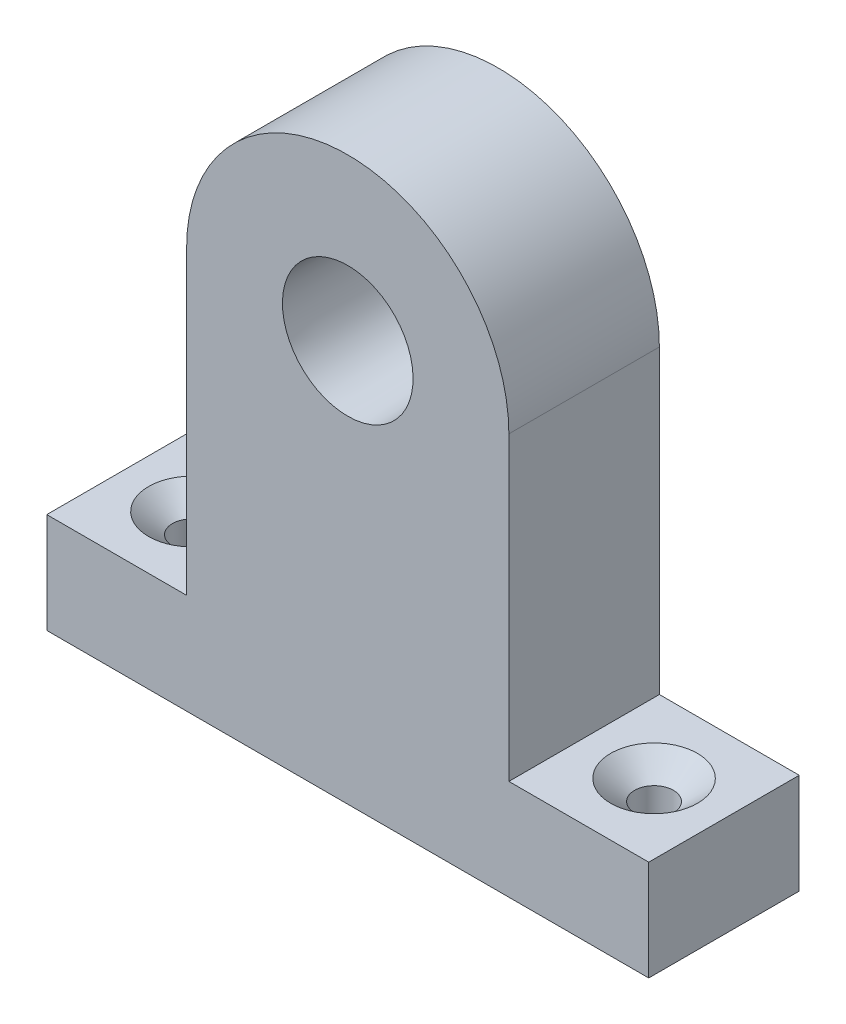
ISO-10303-21;
HEADER;
FILE_DESCRIPTION(('STEP AP214'),'2;1');
FILE_NAME('part.step','',(''),(''),'','','');
FILE_SCHEMA(('AUTOMOTIVE_DESIGN { 1 0 10303 214 1 1 1 1 }'));
ENDSEC;
DATA;
#1=APPLICATION_CONTEXT('core data for automotive mechanical design processes');
#2=APPLICATION_PROTOCOL_DEFINITION('international standard','automotive_design',2000,#1);
#3=PRODUCT_CONTEXT('',#1,'mechanical');
#4=PRODUCT('Part','Part','',(#3));
#5=PRODUCT_RELATED_PRODUCT_CATEGORY('part','',(#4));
#6=PRODUCT_DEFINITION_FORMATION('','',#4);
#7=PRODUCT_DEFINITION_CONTEXT('part definition',#1,'design');
#8=PRODUCT_DEFINITION('design','',#6,#7);
#9=PRODUCT_DEFINITION_SHAPE('','',#8);
#10=(LENGTH_UNIT() NAMED_UNIT(*) SI_UNIT(.MILLI.,.METRE.));
#11=(NAMED_UNIT(*) PLANE_ANGLE_UNIT() SI_UNIT($,.RADIAN.));
#12=(NAMED_UNIT(*) SI_UNIT($,.STERADIAN.) SOLID_ANGLE_UNIT());
#13=UNCERTAINTY_MEASURE_WITH_UNIT(LENGTH_MEASURE(1.E-05),#10,'distance_accuracy_value','');
#14=(GEOMETRIC_REPRESENTATION_CONTEXT(3) GLOBAL_UNCERTAINTY_ASSIGNED_CONTEXT((#13)) GLOBAL_UNIT_ASSIGNED_CONTEXT((#10,
#11,#12)) REPRESENTATION_CONTEXT('',''));
#15=CARTESIAN_POINT('',(0.,0.,0.));
#16=DIRECTION('',(0.,0.,1.));
#17=DIRECTION('',(1.,0.,0.));
#18=AXIS2_PLACEMENT_3D('',#15,#16,#17);
#19=CARTESIAN_POINT('',(-38.1,123.19,-107.95));
#20=DIRECTION('',(1.,0.,0.));
#21=DIRECTION('',(0.,0.,-1.));
#22=AXIS2_PLACEMENT_3D('',#19,#20,#21);
#23=PLANE('',#22);
#24=DIRECTION('',(0.,0.,-1.));
#25=VECTOR('',#24,1.);
#26=CARTESIAN_POINT('',(-38.1,31.75,-88.8999999999999));
#27=LINE('',#26,#25);
#28=CARTESIAN_POINT('',(-38.1,31.75,-88.8999999999999));
#29=VERTEX_POINT('',#28);
#30=CARTESIAN_POINT('',(-38.1,31.75,-107.95));
#31=VERTEX_POINT('',#30);
#32=EDGE_CURVE('E191',#29,#31,#27,.T.);
#33=ORIENTED_EDGE('',*,*,#32,.T.);
#34=DIRECTION('',(0.,-1.,0.));
#35=VECTOR('',#34,1.);
#36=CARTESIAN_POINT('',(-38.1,123.19,-107.95));
#37=LINE('',#36,#35);
#38=CARTESIAN_POINT('',(-38.1,19.05,-107.95));
#39=VERTEX_POINT('',#38);
#40=EDGE_CURVE('E99',#31,#39,#37,.T.);
#41=ORIENTED_EDGE('',*,*,#40,.T.);
#42=DIRECTION('',(0.,0.,1.));
#43=VECTOR('',#42,1.);
#44=CARTESIAN_POINT('',(-38.1,19.05,-107.95));
#45=LINE('',#44,#43);
#46=CARTESIAN_POINT('',(-38.1,19.05,-88.9));
#47=VERTEX_POINT('',#46);
#48=EDGE_CURVE('E197',#39,#47,#45,.T.);
#49=ORIENTED_EDGE('',*,*,#48,.T.);
#50=DIRECTION('',(0.,-1.,0.));
#51=VECTOR('',#50,1.);
#52=CARTESIAN_POINT('',(-38.1,123.19,-88.9));
#53=LINE('',#52,#51);
#54=EDGE_CURVE('E47',#29,#47,#53,.T.);
#55=ORIENTED_EDGE('',*,*,#54,.F.);
#56=EDGE_LOOP('',(#33,#41,#49,#55));
#57=FACE_BOUND('',#56,.T.);
#58=ADVANCED_FACE('F76',(#57),#23,.F.);
#59=CARTESIAN_POINT('',(-38.1,123.19,-88.9));
#60=DIRECTION('',(0.,0.,-1.));
#61=DIRECTION('',(-1.,0.,0.));
#62=AXIS2_PLACEMENT_3D('',#59,#60,#61);
#63=PLANE('',#62);
#64=CARTESIAN_POINT('',(0.,69.8500000000001,-88.9));
#65=DIRECTION('',(0.,0.,-1.));
#66=DIRECTION('',(-1.,0.,0.));
#67=AXIS2_PLACEMENT_3D('',#64,#65,#66);
#68=CIRCLE('',#67,8.26624249261168);
#69=CARTESIAN_POINT('',(0.,61.5837575073885,-88.9));
#70=VERTEX_POINT('',#69);
#71=EDGE_CURVE('E194',#70,#70,#68,.T.);
#72=ORIENTED_EDGE('',*,*,#71,.T.);
#73=EDGE_LOOP('',(#72));
#74=FACE_BOUND('',#73,.T.);
#75=DIRECTION('',(0.,-1.,0.));
#76=VECTOR('',#75,1.);
#77=CARTESIAN_POINT('',(38.1,123.19,-88.9));
#78=LINE('',#77,#76);
#79=CARTESIAN_POINT('',(38.1,31.75,-88.9));
#80=VERTEX_POINT('',#79);
#81=CARTESIAN_POINT('',(38.1,19.05,-88.9));
#82=VERTEX_POINT('',#81);
#83=EDGE_CURVE('E84',#80,#82,#78,.T.);
#84=ORIENTED_EDGE('',*,*,#83,.F.);
#85=DIRECTION('',(-1.,0.,0.));
#86=VECTOR('',#85,1.);
#87=CARTESIAN_POINT('',(0.,31.75,-88.8999999999999));
#88=LINE('',#87,#86);
#89=CARTESIAN_POINT('',(20.3963039680216,31.75,-88.9));
#90=VERTEX_POINT('',#89);
#91=EDGE_CURVE('E174',#80,#90,#88,.T.);
#92=ORIENTED_EDGE('',*,*,#91,.T.);
#93=DIRECTION('',(0.,1.,0.));
#94=VECTOR('',#93,1.);
#95=CARTESIAN_POINT('',(20.3963039680216,0.,-88.9));
#96=LINE('',#95,#94);
#97=CARTESIAN_POINT('',(20.3963039680216,69.8500000000001,-88.9));
#98=VERTEX_POINT('',#97);
#99=EDGE_CURVE('E157',#90,#98,#96,.T.);
#100=ORIENTED_EDGE('',*,*,#99,.T.);
#101=CARTESIAN_POINT('',(0.,69.8500000000001,-88.8999999999999));
#102=DIRECTION('',(0.,0.,-1.));
#103=DIRECTION('',(-1.,0.,0.));
#104=AXIS2_PLACEMENT_3D('',#101,#102,#103);
#105=CIRCLE('',#104,20.3963039680215);
#106=CARTESIAN_POINT('',(-20.3963039680216,69.8500000000001,-88.8999999999999));
#107=VERTEX_POINT('',#106);
#108=EDGE_CURVE('E153',#107,#98,#105,.T.);
#109=ORIENTED_EDGE('',*,*,#108,.F.);
#110=DIRECTION('',(0.,1.,0.));
#111=VECTOR('',#110,1.);
#112=CARTESIAN_POINT('',(-20.3963039680216,0.,-88.8999999999999));
#113=LINE('',#112,#111);
#114=CARTESIAN_POINT('',(-20.3963039680216,31.75,-88.8999999999999));
#115=VERTEX_POINT('',#114);
#116=EDGE_CURVE('E143',#115,#107,#113,.T.);
#117=ORIENTED_EDGE('',*,*,#116,.F.);
#118=DIRECTION('',(1.,0.,0.));
#119=VECTOR('',#118,1.);
#120=CARTESIAN_POINT('',(0.,31.7499999999999,-88.8999999999999));
#121=LINE('',#120,#119);
#122=EDGE_CURVE('E152',#29,#115,#121,.T.);
#123=ORIENTED_EDGE('',*,*,#122,.F.);
#124=ORIENTED_EDGE('',*,*,#54,.T.);
#125=DIRECTION('',(1.,0.,0.));
#126=VECTOR('',#125,1.);
#127=CARTESIAN_POINT('',(-38.1,19.05,-88.9));
#128=LINE('',#127,#126);
#129=EDGE_CURVE('E199',#47,#82,#128,.T.);
#130=ORIENTED_EDGE('',*,*,#129,.T.);
#131=EDGE_LOOP('',(#84,#92,#100,#109,#117,#123,#124,#130));
#132=FACE_BOUND('',#131,.T.);
#133=ADVANCED_FACE('F161',(#74,#132),#63,.F.);
#134=CARTESIAN_POINT('',(38.1,123.19,-107.95));
#135=DIRECTION('',(-1.,0.,0.));
#136=DIRECTION('',(0.,0.,1.));
#137=AXIS2_PLACEMENT_3D('',#134,#135,#136);
#138=PLANE('',#137);
#139=DIRECTION('',(0.,-1.,0.));
#140=VECTOR('',#139,1.);
#141=CARTESIAN_POINT('',(38.1,123.19,-107.95));
#142=LINE('',#141,#140);
#143=CARTESIAN_POINT('',(38.1,31.75,-107.95));
#144=VERTEX_POINT('',#143);
#145=CARTESIAN_POINT('',(38.1,19.05,-107.95));
#146=VERTEX_POINT('',#145);
#147=EDGE_CURVE('E208',#144,#146,#142,.T.);
#148=ORIENTED_EDGE('',*,*,#147,.F.);
#149=DIRECTION('',(0.,0.,-1.));
#150=VECTOR('',#149,1.);
#151=CARTESIAN_POINT('',(38.1,31.75,-88.9));
#152=LINE('',#151,#150);
#153=EDGE_CURVE('E189',#80,#144,#152,.T.);
#154=ORIENTED_EDGE('',*,*,#153,.F.);
#155=ORIENTED_EDGE('',*,*,#83,.T.);
#156=DIRECTION('',(0.,0.,-1.));
#157=VECTOR('',#156,1.);
#158=CARTESIAN_POINT('',(38.1,19.05,-107.95));
#159=LINE('',#158,#157);
#160=EDGE_CURVE('E202',#82,#146,#159,.T.);
#161=ORIENTED_EDGE('',*,*,#160,.T.);
#162=EDGE_LOOP('',(#148,#154,#155,#161));
#163=FACE_BOUND('',#162,.T.);
#164=ADVANCED_FACE('F213',(#163),#138,.F.);
#165=CARTESIAN_POINT('',(-38.1,123.19,-107.95));
#166=DIRECTION('',(0.,0.,1.));
#167=DIRECTION('',(1.,0.,0.));
#168=AXIS2_PLACEMENT_3D('',#165,#166,#167);
#169=PLANE('',#168);
#170=DIRECTION('',(0.,1.,0.));
#171=VECTOR('',#170,1.);
#172=CARTESIAN_POINT('',(20.3963039680216,0.,-107.95));
#173=LINE('',#172,#171);
#174=CARTESIAN_POINT('',(20.3963039680216,31.75,-107.95));
#175=VERTEX_POINT('',#174);
#176=CARTESIAN_POINT('',(20.3963039680216,69.8500000000001,-107.95));
#177=VERTEX_POINT('',#176);
#178=EDGE_CURVE('E164',#175,#177,#173,.T.);
#179=ORIENTED_EDGE('',*,*,#178,.F.);
#180=DIRECTION('',(-1.,0.,0.));
#181=VECTOR('',#180,1.);
#182=CARTESIAN_POINT('',(0.,31.75,-107.95));
#183=LINE('',#182,#181);
#184=EDGE_CURVE('E167',#144,#175,#183,.T.);
#185=ORIENTED_EDGE('',*,*,#184,.F.);
#186=ORIENTED_EDGE('',*,*,#147,.T.);
#187=DIRECTION('',(-1.,0.,0.));
#188=VECTOR('',#187,1.);
#189=CARTESIAN_POINT('',(-38.1,19.05,-107.95));
#190=LINE('',#189,#188);
#191=EDGE_CURVE('E205',#146,#39,#190,.T.);
#192=ORIENTED_EDGE('',*,*,#191,.T.);
#193=ORIENTED_EDGE('',*,*,#40,.F.);
#194=DIRECTION('',(1.,0.,0.));
#195=VECTOR('',#194,1.);
#196=CARTESIAN_POINT('',(0.,31.7499999999999,-107.95));
#197=LINE('',#196,#195);
#198=CARTESIAN_POINT('',(-20.3963039680216,31.75,-107.95));
#199=VERTEX_POINT('',#198);
#200=EDGE_CURVE('E180',#31,#199,#197,.T.);
#201=ORIENTED_EDGE('',*,*,#200,.T.);
#202=DIRECTION('',(0.,1.,0.));
#203=VECTOR('',#202,1.);
#204=CARTESIAN_POINT('',(-20.3963039680216,0.,-107.95));
#205=LINE('',#204,#203);
#206=CARTESIAN_POINT('',(-20.3963039680216,69.8500000000001,-107.95));
#207=VERTEX_POINT('',#206);
#208=EDGE_CURVE('E178',#199,#207,#205,.T.);
#209=ORIENTED_EDGE('',*,*,#208,.T.);
#210=CARTESIAN_POINT('',(0.,69.8500000000001,-107.95));
#211=DIRECTION('',(0.,0.,-1.));
#212=DIRECTION('',(-1.,0.,0.));
#213=AXIS2_PLACEMENT_3D('',#210,#211,#212);
#214=CIRCLE('',#213,20.3963039680215);
#215=EDGE_CURVE('E91',#207,#177,#214,.T.);
#216=ORIENTED_EDGE('',*,*,#215,.T.);
#217=EDGE_LOOP('',(#179,#185,#186,#192,#193,#201,#209,#216));
#218=FACE_BOUND('',#217,.T.);
#219=CARTESIAN_POINT('',(0.,69.8500000000001,-107.95));
#220=DIRECTION('',(0.,0.,1.));
#221=DIRECTION('',(1.,0.,0.));
#222=AXIS2_PLACEMENT_3D('',#219,#220,#221);
#223=CIRCLE('',#222,7.69630396802151);
#224=CARTESIAN_POINT('',(0.,62.1536960319786,-107.95));
#225=VERTEX_POINT('',#224);
#226=EDGE_CURVE('E79',#225,#225,#223,.T.);
#227=ORIENTED_EDGE('',*,*,#226,.T.);
#228=EDGE_LOOP('',(#227));
#229=FACE_BOUND('',#228,.T.);
#230=ADVANCED_FACE('F223',(#218,#229),#169,.F.);
#231=CARTESIAN_POINT('',(0.,19.05,0.));
#232=DIRECTION('',(0.,1.,0.));
#233=DIRECTION('',(0.,0.,1.));
#234=AXIS2_PLACEMENT_3D('',#231,#232,#233);
#235=PLANE('',#234);
#236=CARTESIAN_POINT('',(-29.2481519840108,19.05,-98.425));
#237=DIRECTION('',(0.,1.,0.));
#238=DIRECTION('',(0.,0.,1.));
#239=AXIS2_PLACEMENT_3D('',#236,#237,#238);
#240=CIRCLE('',#239,2.45744999999999);
#241=CARTESIAN_POINT('',(-29.2481519840108,19.05,-95.96755));
#242=VERTEX_POINT('',#241);
#243=EDGE_CURVE('E288',#242,#242,#240,.T.);
#244=ORIENTED_EDGE('',*,*,#243,.T.);
#245=EDGE_LOOP('',(#244));
#246=FACE_BOUND('',#245,.T.);
#247=CARTESIAN_POINT('',(29.2481519840108,19.05,-98.425));
#248=DIRECTION('',(0.,1.,0.));
#249=DIRECTION('',(0.,0.,1.));
#250=AXIS2_PLACEMENT_3D('',#247,#248,#249);
#251=CIRCLE('',#250,2.45744999999999);
#252=CARTESIAN_POINT('',(29.2481519840108,19.05,-95.96755));
#253=VERTEX_POINT('',#252);
#254=EDGE_CURVE('E170',#253,#253,#251,.T.);
#255=ORIENTED_EDGE('',*,*,#254,.T.);
#256=EDGE_LOOP('',(#255));
#257=FACE_BOUND('',#256,.T.);
#258=ORIENTED_EDGE('',*,*,#48,.F.);
#259=ORIENTED_EDGE('',*,*,#191,.F.);
#260=ORIENTED_EDGE('',*,*,#160,.F.);
#261=ORIENTED_EDGE('',*,*,#129,.F.);
#262=EDGE_LOOP('',(#258,#259,#260,#261));
#263=FACE_BOUND('',#262,.T.);
#264=ADVANCED_FACE('F220',(#246,#257,#263),#235,.F.);
#265=CARTESIAN_POINT('',(0.,69.8500000000001,-64.5055523260613));
#266=DIRECTION('',(0.,0.,1.));
#267=DIRECTION('',(0.,-1.,0.));
#268=AXIS2_PLACEMENT_3D('',#265,#266,#267);
#269=CONICAL_SURFACE('',#268,8.99607637793853,0.0299091111469074);
#270=CARTESIAN_POINT('',(0.,62.1536960319786,-107.95));
#271=CARTESIAN_POINT('',(0.,62.1477591723475,-107.7515625));
#272=CARTESIAN_POINT('',(0.,62.1418223127163,-107.553125));
#273=CARTESIAN_POINT('',(0.,62.129948593454,-107.15625));
#274=CARTESIAN_POINT('',(0.,62.1240117338229,-106.9578125));
#275=CARTESIAN_POINT('',(0.,62.1121380145606,-106.5609375));
#276=CARTESIAN_POINT('',(0.,62.1062011549294,-106.3625));
#277=CARTESIAN_POINT('',(0.,62.0943274356671,-105.965625));
#278=CARTESIAN_POINT('',(0.,62.088390576036,-105.7671875));
#279=CARTESIAN_POINT('',(0.,62.0765168567737,-105.3703125));
#280=CARTESIAN_POINT('',(0.,62.0705799971426,-105.171875));
#281=CARTESIAN_POINT('',(0.,62.0587062778803,-104.775));
#282=CARTESIAN_POINT('',(0.,62.0527694182491,-104.5765625));
#283=CARTESIAN_POINT('',(0.,62.0408956989868,-104.1796875));
#284=CARTESIAN_POINT('',(0.,62.0349588393557,-103.98125));
#285=CARTESIAN_POINT('',(0.,62.0230851200934,-103.584375));
#286=CARTESIAN_POINT('',(0.,62.0171482604622,-103.3859375));
#287=CARTESIAN_POINT('',(0.,62.0052745411999,-102.9890625));
#288=CARTESIAN_POINT('',(0.,61.9993376815688,-102.790625));
#289=CARTESIAN_POINT('',(0.,61.9874639623065,-102.39375));
#290=CARTESIAN_POINT('',(0.,61.9815271026753,-102.1953125));
#291=CARTESIAN_POINT('',(0.,61.969653383413,-101.7984375));
#292=CARTESIAN_POINT('',(0.,61.9637165237819,-101.6));
#293=CARTESIAN_POINT('',(0.,61.9518428045196,-101.203125));
#294=CARTESIAN_POINT('',(0.,61.9459059448885,-101.0046875));
#295=CARTESIAN_POINT('',(0.,61.9340322256262,-100.6078125));
#296=CARTESIAN_POINT('',(0.,61.928095365995,-100.409375));
#297=CARTESIAN_POINT('',(0.,61.9162216467327,-100.0125));
#298=CARTESIAN_POINT('',(0.,61.9102847871016,-99.8140625));
#299=CARTESIAN_POINT('',(0.,61.8984110678393,-99.4171875));
#300=CARTESIAN_POINT('',(0.,61.8924742082081,-99.21875));
#301=CARTESIAN_POINT('',(0.,61.8806004889458,-98.821875));
#302=CARTESIAN_POINT('',(0.,61.8746636293147,-98.6234375));
#303=CARTESIAN_POINT('',(0.,61.8627899100524,-98.2265625));
#304=CARTESIAN_POINT('',(0.,61.8568530504212,-98.028125));
#305=CARTESIAN_POINT('',(0.,61.8449793311589,-97.63125));
#306=CARTESIAN_POINT('',(0.,61.8390424715278,-97.4328125));
#307=CARTESIAN_POINT('',(0.,61.8271687522655,-97.0359375));
#308=CARTESIAN_POINT('',(0.,61.8212318926344,-96.8375));
#309=CARTESIAN_POINT('',(0.,61.8093581733721,-96.440625));
#310=CARTESIAN_POINT('',(0.,61.8034213137409,-96.2421875));
#311=CARTESIAN_POINT('',(0.,61.7915475944786,-95.8453125));
#312=CARTESIAN_POINT('',(0.,61.7856107348475,-95.646875));
#313=CARTESIAN_POINT('',(0.,61.7737370155852,-95.25));
#314=CARTESIAN_POINT('',(0.,61.767800155954,-95.0515625));
#315=CARTESIAN_POINT('',(0.,61.7559264366917,-94.6546875));
#316=CARTESIAN_POINT('',(0.,61.7499895770606,-94.45625));
#317=CARTESIAN_POINT('',(0.,61.7381158577983,-94.059375));
#318=CARTESIAN_POINT('',(0.,61.7321789981671,-93.8609375));
#319=CARTESIAN_POINT('',(0.,61.7203052789048,-93.4640625));
#320=CARTESIAN_POINT('',(0.,61.7143684192737,-93.265625));
#321=CARTESIAN_POINT('',(0.,61.7024947000114,-92.86875));
#322=CARTESIAN_POINT('',(0.,61.6965578403803,-92.6703125));
#323=CARTESIAN_POINT('',(0.,61.684684121118,-92.2734375));
#324=CARTESIAN_POINT('',(0.,61.6787472614868,-92.075));
#325=CARTESIAN_POINT('',(0.,61.6668735422245,-91.678125));
#326=CARTESIAN_POINT('',(0.,61.6609366825934,-91.4796875));
#327=CARTESIAN_POINT('',(0.,61.6490629633311,-91.0828125));
#328=CARTESIAN_POINT('',(0.,61.6431261036999,-90.884375));
#329=CARTESIAN_POINT('',(0.,61.6312523844376,-90.4875));
#330=CARTESIAN_POINT('',(0.,61.6253155248065,-90.2890625));
#331=CARTESIAN_POINT('',(0.,61.6134418055442,-89.8921875));
#332=CARTESIAN_POINT('',(0.,61.607504945913,-89.69375));
#333=CARTESIAN_POINT('',(0.,61.5956312266507,-89.296875));
#334=CARTESIAN_POINT('',(0.,61.5896943670196,-89.0984375));
#335=CARTESIAN_POINT('',(0.,61.5837575073885,-88.9));
#336=B_SPLINE_CURVE_WITH_KNOTS('',3,(#270,#271,#272,#273,#274,#275,#276,#277,#278,#279,#280,
#281,#282,#283,#284,#285,#286,#287,#288,#289,#290,#291,#292,#293,#294,#295,#296,#297,#298,#299,
#300,#301,#302,#303,#304,#305,#306,#307,#308,#309,#310,#311,#312,#313,#314,#315,#316,#317,#318,
#319,#320,#321,#322,#323,#324,#325,#326,#327,#328,#329,#330,#331,#332,#333,#334,#335),
.UNSPECIFIED.,.F.,.F.,(4,2,2,2,2,2,2,2,2,2,2,2,2,2,2,2,2,2,2,2,2,2,2,2,2,2,2,2,2,2,2,2,4),(0.,
0.595578869148973,1.19115773829795,1.78673660744692,2.38231547659589,2.97789434574487,
3.57347321489385,4.16905208404283,4.7646309531918,5.36020982234077,5.95578869148975,
6.55136756063872,7.1469464297877,7.74252529893667,8.33810416808564,8.93368303723461,
9.52926190638359,10.1248407755326,10.7204196446815,11.3159985138305,11.9115773829795,
12.5071562521285,13.1027351212774,13.6983139904264,14.2938928595754,14.8894717287243,
15.4850505978733,16.0806294670223,16.6762083361713,17.2717872053202,17.8673660744692,
18.4629449436182,19.0585238127672),.UNSPECIFIED.);
#337=EDGE_CURVE('BSEAM246',#225,#70,#336,.T.);
#338=ORIENTED_EDGE('',*,*,#226,.F.);
#339=ORIENTED_EDGE('',*,*,#71,.F.);
#340=ORIENTED_EDGE('',*,*,#337,.T.);
#341=ORIENTED_EDGE('',*,*,#337,.F.);
#342=EDGE_LOOP('',(#338,#340,#339,#341));
#343=FACE_BOUND('',#342,.T.);
#344=ADVANCED_FACE('F246',(#343),#269,.F.);
#345=CARTESIAN_POINT('',(0.,69.8500000000001,-88.8999999999999));
#346=DIRECTION('',(0.,0.,-1.));
#347=DIRECTION('',(-1.,0.,0.));
#348=AXIS2_PLACEMENT_3D('',#345,#346,#347);
#349=CYLINDRICAL_SURFACE('',#348,20.3963039680215);
#350=ORIENTED_EDGE('',*,*,#215,.F.);
#351=DIRECTION('',(0.,0.,-1.));
#352=VECTOR('',#351,1.);
#353=CARTESIAN_POINT('',(-20.3963039680216,69.8500000000001,-88.8999999999999));
#354=LINE('',#353,#352);
#355=EDGE_CURVE('E146',#107,#207,#354,.T.);
#356=ORIENTED_EDGE('',*,*,#355,.F.);
#357=ORIENTED_EDGE('',*,*,#108,.T.);
#358=DIRECTION('',(0.,0.,-1.));
#359=VECTOR('',#358,1.);
#360=CARTESIAN_POINT('',(20.3963039680216,69.8500000000001,-88.9));
#361=LINE('',#360,#359);
#362=EDGE_CURVE('E185',#98,#177,#361,.T.);
#363=ORIENTED_EDGE('',*,*,#362,.T.);
#364=EDGE_LOOP('',(#350,#356,#357,#363));
#365=FACE_BOUND('',#364,.T.);
#366=ADVANCED_FACE('F155',(#365),#349,.T.);
#367=CARTESIAN_POINT('',(20.3963039680216,0.,-88.9));
#368=DIRECTION('',(-1.,0.,0.));
#369=DIRECTION('',(0.,0.,1.));
#370=AXIS2_PLACEMENT_3D('',#367,#368,#369);
#371=PLANE('',#370);
#372=ORIENTED_EDGE('',*,*,#178,.T.);
#373=ORIENTED_EDGE('',*,*,#362,.F.);
#374=ORIENTED_EDGE('',*,*,#99,.F.);
#375=DIRECTION('',(0.,0.,-1.));
#376=VECTOR('',#375,1.);
#377=CARTESIAN_POINT('',(20.3963039680216,31.75,-88.9));
#378=LINE('',#377,#376);
#379=EDGE_CURVE('E187',#90,#175,#378,.T.);
#380=ORIENTED_EDGE('',*,*,#379,.T.);
#381=EDGE_LOOP('',(#372,#373,#374,#380));
#382=FACE_BOUND('',#381,.T.);
#383=ADVANCED_FACE('F229',(#382),#371,.F.);
#384=CARTESIAN_POINT('',(0.,31.75,-88.8999999999999));
#385=DIRECTION('',(0.,-1.,0.));
#386=DIRECTION('',(0.,0.,-1.));
#387=AXIS2_PLACEMENT_3D('',#384,#385,#386);
#388=PLANE('',#387);
#389=CARTESIAN_POINT('',(29.2481519840108,31.75,-98.425));
#390=DIRECTION('',(0.,1.,0.));
#391=DIRECTION('',(0.,0.,1.));
#392=AXIS2_PLACEMENT_3D('',#389,#390,#391);
#393=CIRCLE('',#392,5.4864);
#394=CARTESIAN_POINT('',(29.2481519840108,31.75,-92.9386));
#395=VERTEX_POINT('',#394);
#396=EDGE_CURVE('E293',#395,#395,#393,.T.);
#397=ORIENTED_EDGE('',*,*,#396,.F.);
#398=EDGE_LOOP('',(#397));
#399=FACE_BOUND('',#398,.T.);
#400=ORIENTED_EDGE('',*,*,#184,.T.);
#401=ORIENTED_EDGE('',*,*,#379,.F.);
#402=ORIENTED_EDGE('',*,*,#91,.F.);
#403=ORIENTED_EDGE('',*,*,#153,.T.);
#404=EDGE_LOOP('',(#400,#401,#402,#403));
#405=FACE_BOUND('',#404,.T.);
#406=ADVANCED_FACE('F227',(#399,#405),#388,.F.);
#407=CARTESIAN_POINT('',(0.,31.7499999999999,-88.8999999999999));
#408=DIRECTION('',(0.,1.,0.));
#409=DIRECTION('',(-1.,0.,0.));
#410=AXIS2_PLACEMENT_3D('',#407,#408,#409);
#411=PLANE('',#410);
#412=CARTESIAN_POINT('',(-29.2481519840108,31.75,-98.425));
#413=DIRECTION('',(0.,1.,0.));
#414=DIRECTION('',(0.,0.,1.));
#415=AXIS2_PLACEMENT_3D('',#412,#413,#414);
#416=CIRCLE('',#415,5.4864);
#417=CARTESIAN_POINT('',(-29.2481519840108,31.75,-92.9386));
#418=VERTEX_POINT('',#417);
#419=EDGE_CURVE('E286',#418,#418,#416,.T.);
#420=ORIENTED_EDGE('',*,*,#419,.F.);
#421=EDGE_LOOP('',(#420));
#422=FACE_BOUND('',#421,.T.);
#423=ORIENTED_EDGE('',*,*,#200,.F.);
#424=ORIENTED_EDGE('',*,*,#32,.F.);
#425=ORIENTED_EDGE('',*,*,#122,.T.);
#426=DIRECTION('',(0.,0.,-1.));
#427=VECTOR('',#426,1.);
#428=CARTESIAN_POINT('',(-20.3963039680216,31.75,-88.8999999999999));
#429=LINE('',#428,#427);
#430=EDGE_CURVE('E148',#115,#199,#429,.T.);
#431=ORIENTED_EDGE('',*,*,#430,.T.);
#432=EDGE_LOOP('',(#423,#424,#425,#431));
#433=FACE_BOUND('',#432,.T.);
#434=ADVANCED_FACE('F231',(#422,#433),#411,.T.);
#435=CARTESIAN_POINT('',(-20.3963039680216,0.,-88.8999999999999));
#436=DIRECTION('',(-1.,0.,0.));
#437=DIRECTION('',(0.,0.,1.));
#438=AXIS2_PLACEMENT_3D('',#435,#436,#437);
#439=PLANE('',#438);
#440=ORIENTED_EDGE('',*,*,#208,.F.);
#441=ORIENTED_EDGE('',*,*,#430,.F.);
#442=ORIENTED_EDGE('',*,*,#116,.T.);
#443=ORIENTED_EDGE('',*,*,#355,.T.);
#444=EDGE_LOOP('',(#440,#441,#442,#443));
#445=FACE_BOUND('',#444,.T.);
#446=ADVANCED_FACE('F145',(#445),#439,.T.);
#447=CARTESIAN_POINT('',(29.2481519840108,31.75,-98.425));
#448=DIRECTION('',(0.,1.,0.));
#449=DIRECTION('',(0.,0.,1.));
#450=AXIS2_PLACEMENT_3D('',#447,#448,#449);
#451=CYLINDRICAL_SURFACE('',#450,2.45744999999999);
#452=ORIENTED_EDGE('',*,*,#254,.F.);
#453=EDGE_LOOP('',(#452));
#454=FACE_BOUND('',#453,.T.);
#455=CARTESIAN_POINT('',(29.2481519840108,29.2084091721456,-98.425));
#456=DIRECTION('',(0.,1.,0.));
#457=DIRECTION('',(0.,0.,1.));
#458=AXIS2_PLACEMENT_3D('',#455,#456,#457);
#459=CIRCLE('',#458,2.45744999999999);
#460=CARTESIAN_POINT('',(29.2481519840108,29.2084091721456,-95.96755));
#461=VERTEX_POINT('',#460);
#462=EDGE_CURVE('E295',#461,#461,#459,.T.);
#463=ORIENTED_EDGE('',*,*,#462,.T.);
#464=EDGE_LOOP('',(#463));
#465=FACE_BOUND('',#464,.T.);
#466=ADVANCED_FACE('F255',(#454,#465),#451,.F.);
#467=CARTESIAN_POINT('',(29.2481519840108,31.75,-98.425));
#468=DIRECTION('',(0.,1.,0.));
#469=DIRECTION('',(0.,0.,1.));
#470=AXIS2_PLACEMENT_3D('',#467,#468,#469);
#471=CONICAL_SURFACE('',#470,5.4864,0.872664625997167);
#472=ORIENTED_EDGE('',*,*,#462,.F.);
#473=EDGE_LOOP('',(#472));
#474=FACE_BOUND('',#473,.T.);
#475=ORIENTED_EDGE('',*,*,#396,.T.);
#476=EDGE_LOOP('',(#475));
#477=FACE_BOUND('',#476,.T.);
#478=ADVANCED_FACE('F266',(#474,#477),#471,.F.);
#479=CARTESIAN_POINT('',(-29.2481519840108,31.75,-98.425));
#480=DIRECTION('',(0.,1.,0.));
#481=DIRECTION('',(0.,0.,1.));
#482=AXIS2_PLACEMENT_3D('',#479,#480,#481);
#483=CYLINDRICAL_SURFACE('',#482,2.45744999999999);
#484=ORIENTED_EDGE('',*,*,#243,.F.);
#485=EDGE_LOOP('',(#484));
#486=FACE_BOUND('',#485,.T.);
#487=CARTESIAN_POINT('',(-29.2481519840108,29.2084091721456,-98.425));
#488=DIRECTION('',(0.,1.,0.));
#489=DIRECTION('',(0.,0.,1.));
#490=AXIS2_PLACEMENT_3D('',#487,#488,#489);
#491=CIRCLE('',#490,2.45744999999999);
#492=CARTESIAN_POINT('',(-29.2481519840108,29.2084091721456,-95.96755));
#493=VERTEX_POINT('',#492);
#494=EDGE_CURVE('E283',#493,#493,#491,.T.);
#495=ORIENTED_EDGE('',*,*,#494,.T.);
#496=EDGE_LOOP('',(#495));
#497=FACE_BOUND('',#496,.T.);
#498=ADVANCED_FACE('F270',(#486,#497),#483,.F.);
#499=CARTESIAN_POINT('',(-29.2481519840108,31.75,-98.425));
#500=DIRECTION('',(0.,1.,0.));
#501=DIRECTION('',(0.,0.,1.));
#502=AXIS2_PLACEMENT_3D('',#499,#500,#501);
#503=CONICAL_SURFACE('',#502,5.4864,0.872664625997167);
#504=ORIENTED_EDGE('',*,*,#494,.F.);
#505=EDGE_LOOP('',(#504));
#506=FACE_BOUND('',#505,.T.);
#507=ORIENTED_EDGE('',*,*,#419,.T.);
#508=EDGE_LOOP('',(#507));
#509=FACE_BOUND('',#508,.T.);
#510=ADVANCED_FACE('F274',(#506,#509),#503,.F.);
#511=CLOSED_SHELL('',(#58,#133,#164,#230,#264,#344,#366,#383,#406,#434,#446,#466,#478,#498,#510));
#512=MANIFOLD_SOLID_BREP('B6',#511);
#513=ADVANCED_BREP_SHAPE_REPRESENTATION('',(#18,#512),#14);
#514=SHAPE_DEFINITION_REPRESENTATION(#9,#513);
ENDSEC;
END-ISO-10303-21;
